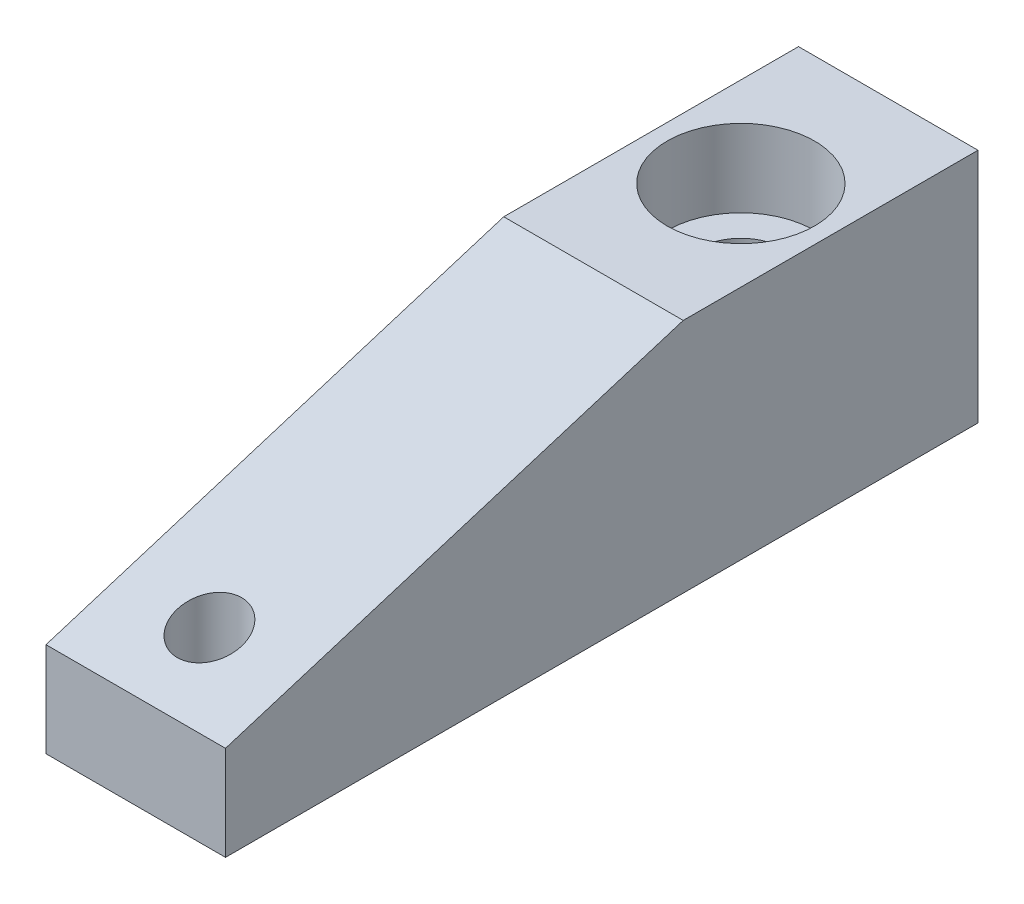
ISO-10303-21;
HEADER;
FILE_DESCRIPTION(('STEP AP214'),'2;1');
FILE_NAME('part.step','',(''),(''),'','','');
FILE_SCHEMA(('AUTOMOTIVE_DESIGN { 1 0 10303 214 1 1 1 1 }'));
ENDSEC;
DATA;
#1=APPLICATION_CONTEXT('core data for automotive mechanical design processes');
#2=APPLICATION_PROTOCOL_DEFINITION('international standard','automotive_design',2000,#1);
#3=PRODUCT_CONTEXT('',#1,'mechanical');
#4=PRODUCT('Part','Part','',(#3));
#5=PRODUCT_RELATED_PRODUCT_CATEGORY('part','',(#4));
#6=PRODUCT_DEFINITION_FORMATION('','',#4);
#7=PRODUCT_DEFINITION_CONTEXT('part definition',#1,'design');
#8=PRODUCT_DEFINITION('design','',#6,#7);
#9=PRODUCT_DEFINITION_SHAPE('','',#8);
#10=(LENGTH_UNIT() NAMED_UNIT(*) SI_UNIT(.MILLI.,.METRE.));
#11=(NAMED_UNIT(*) PLANE_ANGLE_UNIT() SI_UNIT($,.RADIAN.));
#12=(NAMED_UNIT(*) SI_UNIT($,.STERADIAN.) SOLID_ANGLE_UNIT());
#13=UNCERTAINTY_MEASURE_WITH_UNIT(LENGTH_MEASURE(1.E-05),#10,'distance_accuracy_value','');
#14=(GEOMETRIC_REPRESENTATION_CONTEXT(3) GLOBAL_UNCERTAINTY_ASSIGNED_CONTEXT((#13)) GLOBAL_UNIT_ASSIGNED_CONTEXT((#10,
#11,#12)) REPRESENTATION_CONTEXT('',''));
#15=CARTESIAN_POINT('',(0.,0.,0.));
#16=DIRECTION('',(0.,0.,1.));
#17=DIRECTION('',(1.,0.,0.));
#18=AXIS2_PLACEMENT_3D('',#15,#16,#17);
#19=CARTESIAN_POINT('',(0.,12.7,0.));
#20=DIRECTION('',(1.,0.,0.));
#21=DIRECTION('',(0.,0.,-1.));
#22=AXIS2_PLACEMENT_3D('',#19,#20,#21);
#23=PLANE('',#22);
#24=DIRECTION('',(0.,-1.,0.));
#25=VECTOR('',#24,1.);
#26=CARTESIAN_POINT('',(0.,12.7,40.4622));
#27=LINE('',#26,#25);
#28=CARTESIAN_POINT('',(0.,5.08,40.4622));
#29=VERTEX_POINT('',#28);
#30=CARTESIAN_POINT('',(0.,0.,40.4622));
#31=VERTEX_POINT('',#30);
#32=EDGE_CURVE('E117',#29,#31,#27,.T.);
#33=ORIENTED_EDGE('',*,*,#32,.F.);
#34=DIRECTION('',(0.,0.295747987182093,-0.95526599859816));
#35=VECTOR('',#34,1.);
#36=CARTESIAN_POINT('',(0.,5.08,40.4622));
#37=LINE('',#36,#35);
#38=CARTESIAN_POINT('',(0.,12.7,15.8496));
#39=VERTEX_POINT('',#38);
#40=EDGE_CURVE('E183',#29,#39,#37,.T.);
#41=ORIENTED_EDGE('',*,*,#40,.T.);
#42=DIRECTION('',(0.,0.,1.));
#43=VECTOR('',#42,1.);
#44=CARTESIAN_POINT('',(0.,12.7,0.));
#45=LINE('',#44,#43);
#46=CARTESIAN_POINT('',(0.,12.7,0.));
#47=VERTEX_POINT('',#46);
#48=EDGE_CURVE('E91',#47,#39,#45,.T.);
#49=ORIENTED_EDGE('',*,*,#48,.F.);
#50=DIRECTION('',(0.,-1.,0.));
#51=VECTOR('',#50,1.);
#52=CARTESIAN_POINT('',(0.,12.7,0.));
#53=LINE('',#52,#51);
#54=CARTESIAN_POINT('',(0.,0.,0.));
#55=VERTEX_POINT('',#54);
#56=EDGE_CURVE('E84',#47,#55,#53,.T.);
#57=ORIENTED_EDGE('',*,*,#56,.T.);
#58=DIRECTION('',(0.,0.,1.));
#59=VECTOR('',#58,1.);
#60=CARTESIAN_POINT('',(0.,0.,0.));
#61=LINE('',#60,#59);
#62=EDGE_CURVE('E97',#55,#31,#61,.T.);
#63=ORIENTED_EDGE('',*,*,#62,.T.);
#64=EDGE_LOOP('',(#33,#41,#49,#57,#63));
#65=FACE_BOUND('',#64,.T.);
#66=ADVANCED_FACE('F37',(#65),#23,.F.);
#67=CARTESIAN_POINT('',(0.,12.7,40.4622));
#68=DIRECTION('',(0.,0.,-1.));
#69=DIRECTION('',(-1.,0.,0.));
#70=AXIS2_PLACEMENT_3D('',#67,#68,#69);
#71=PLANE('',#70);
#72=DIRECTION('',(0.,-1.,0.));
#73=VECTOR('',#72,1.);
#74=CARTESIAN_POINT('',(9.652,12.7,40.4622));
#75=LINE('',#74,#73);
#76=CARTESIAN_POINT('',(9.652,5.08,40.4622));
#77=VERTEX_POINT('',#76);
#78=CARTESIAN_POINT('',(9.652,0.,40.4622));
#79=VERTEX_POINT('',#78);
#80=EDGE_CURVE('E115',#77,#79,#75,.T.);
#81=ORIENTED_EDGE('',*,*,#80,.F.);
#82=DIRECTION('',(1.,0.,0.));
#83=VECTOR('',#82,1.);
#84=CARTESIAN_POINT('',(0.,5.08,40.4622));
#85=LINE('',#84,#83);
#86=EDGE_CURVE('E187',#29,#77,#85,.T.);
#87=ORIENTED_EDGE('',*,*,#86,.F.);
#88=ORIENTED_EDGE('',*,*,#32,.T.);
#89=DIRECTION('',(1.,0.,0.));
#90=VECTOR('',#89,1.);
#91=CARTESIAN_POINT('',(0.,0.,40.4622));
#92=LINE('',#91,#90);
#93=EDGE_CURVE('E103',#31,#79,#92,.T.);
#94=ORIENTED_EDGE('',*,*,#93,.T.);
#95=EDGE_LOOP('',(#81,#87,#88,#94));
#96=FACE_BOUND('',#95,.T.);
#97=ADVANCED_FACE('F139',(#96),#71,.F.);
#98=CARTESIAN_POINT('',(9.652,12.7,0.));
#99=DIRECTION('',(-1.,0.,0.));
#100=DIRECTION('',(0.,0.,1.));
#101=AXIS2_PLACEMENT_3D('',#98,#99,#100);
#102=PLANE('',#101);
#103=DIRECTION('',(0.,0.,-1.));
#104=VECTOR('',#103,1.);
#105=CARTESIAN_POINT('',(9.652,12.7,0.));
#106=LINE('',#105,#104);
#107=CARTESIAN_POINT('',(9.652,12.7,15.8496));
#108=VERTEX_POINT('',#107);
#109=CARTESIAN_POINT('',(9.652,12.7,0.));
#110=VERTEX_POINT('',#109);
#111=EDGE_CURVE('E203',#108,#110,#106,.T.);
#112=ORIENTED_EDGE('',*,*,#111,.F.);
#113=DIRECTION('',(0.,0.295747987182093,-0.95526599859816));
#114=VECTOR('',#113,1.);
#115=CARTESIAN_POINT('',(9.652,5.08,40.4622));
#116=LINE('',#115,#114);
#117=EDGE_CURVE('E53',#77,#108,#116,.T.);
#118=ORIENTED_EDGE('',*,*,#117,.F.);
#119=ORIENTED_EDGE('',*,*,#80,.T.);
#120=DIRECTION('',(0.,0.,-1.));
#121=VECTOR('',#120,1.);
#122=CARTESIAN_POINT('',(9.652,0.,0.));
#123=LINE('',#122,#121);
#124=CARTESIAN_POINT('',(9.652,0.,0.));
#125=VERTEX_POINT('',#124);
#126=EDGE_CURVE('E92',#79,#125,#123,.T.);
#127=ORIENTED_EDGE('',*,*,#126,.T.);
#128=DIRECTION('',(0.,-1.,0.));
#129=VECTOR('',#128,1.);
#130=CARTESIAN_POINT('',(9.652,12.7,0.));
#131=LINE('',#130,#129);
#132=EDGE_CURVE('E87',#110,#125,#131,.T.);
#133=ORIENTED_EDGE('',*,*,#132,.F.);
#134=EDGE_LOOP('',(#112,#118,#119,#127,#133));
#135=FACE_BOUND('',#134,.T.);
#136=ADVANCED_FACE('F143',(#135),#102,.F.);
#137=CARTESIAN_POINT('',(0.,12.7,0.));
#138=DIRECTION('',(0.,0.,1.));
#139=DIRECTION('',(1.,0.,0.));
#140=AXIS2_PLACEMENT_3D('',#137,#138,#139);
#141=PLANE('',#140);
#142=DIRECTION('',(-1.,0.,0.));
#143=VECTOR('',#142,1.);
#144=CARTESIAN_POINT('',(0.,0.,0.));
#145=LINE('',#144,#143);
#146=EDGE_CURVE('E81',#125,#55,#145,.T.);
#147=ORIENTED_EDGE('',*,*,#146,.T.);
#148=ORIENTED_EDGE('',*,*,#56,.F.);
#149=DIRECTION('',(-1.,0.,0.));
#150=VECTOR('',#149,1.);
#151=CARTESIAN_POINT('',(0.,12.7,0.));
#152=LINE('',#151,#150);
#153=EDGE_CURVE('E62',#110,#47,#152,.T.);
#154=ORIENTED_EDGE('',*,*,#153,.F.);
#155=ORIENTED_EDGE('',*,*,#132,.T.);
#156=EDGE_LOOP('',(#147,#148,#154,#155));
#157=FACE_BOUND('',#156,.T.);
#158=ADVANCED_FACE('F83',(#157),#141,.F.);
#159=CARTESIAN_POINT('',(0.,12.7,0.));
#160=DIRECTION('',(0.,1.,0.));
#161=DIRECTION('',(0.,0.,1.));
#162=AXIS2_PLACEMENT_3D('',#159,#160,#161);
#163=PLANE('',#162);
#164=DIRECTION('',(1.,0.,0.));
#165=VECTOR('',#164,1.);
#166=CARTESIAN_POINT('',(0.,12.7,15.8496));
#167=LINE('',#166,#165);
#168=EDGE_CURVE('E189',#39,#108,#167,.T.);
#169=ORIENTED_EDGE('',*,*,#168,.T.);
#170=ORIENTED_EDGE('',*,*,#111,.T.);
#171=ORIENTED_EDGE('',*,*,#153,.T.);
#172=ORIENTED_EDGE('',*,*,#48,.T.);
#173=EDGE_LOOP('',(#169,#170,#171,#172));
#174=FACE_BOUND('',#173,.T.);
#175=CARTESIAN_POINT('',(4.826,12.7,7.9248));
#176=DIRECTION('',(0.,1.,0.));
#177=DIRECTION('',(0.,0.,1.));
#178=AXIS2_PLACEMENT_3D('',#175,#176,#177);
#179=CIRCLE('',#178,3.9624);
#180=CARTESIAN_POINT('',(4.826,12.7,11.8872));
#181=VERTEX_POINT('',#180);
#182=EDGE_CURVE('E104',#181,#181,#179,.T.);
#183=ORIENTED_EDGE('',*,*,#182,.F.);
#184=EDGE_LOOP('',(#183));
#185=FACE_BOUND('',#184,.T.);
#186=ADVANCED_FACE('F152',(#174,#185),#163,.T.);
#187=CARTESIAN_POINT('',(0.,0.,0.));
#188=DIRECTION('',(0.,1.,0.));
#189=DIRECTION('',(0.,0.,1.));
#190=AXIS2_PLACEMENT_3D('',#187,#188,#189);
#191=PLANE('',#190);
#192=CARTESIAN_POINT('',(4.826,0.,36.4998));
#193=DIRECTION('',(0.,-1.,0.));
#194=DIRECTION('',(0.,0.,-1.));
#195=AXIS2_PLACEMENT_3D('',#192,#193,#194);
#196=CIRCLE('',#195,1.7272);
#197=CARTESIAN_POINT('',(4.826,0.,34.7726));
#198=VERTEX_POINT('',#197);
#199=EDGE_CURVE('E180',#198,#198,#196,.T.);
#200=ORIENTED_EDGE('',*,*,#199,.F.);
#201=EDGE_LOOP('',(#200));
#202=FACE_BOUND('',#201,.T.);
#203=CARTESIAN_POINT('',(4.826,0.,7.9248));
#204=DIRECTION('',(0.,1.,0.));
#205=DIRECTION('',(0.,0.,1.));
#206=AXIS2_PLACEMENT_3D('',#203,#204,#205);
#207=CIRCLE('',#206,3.1115);
#208=CARTESIAN_POINT('',(4.826,0.,11.0363));
#209=VERTEX_POINT('',#208);
#210=EDGE_CURVE('E191',#209,#209,#207,.T.);
#211=ORIENTED_EDGE('',*,*,#210,.T.);
#212=EDGE_LOOP('',(#211));
#213=FACE_BOUND('',#212,.T.);
#214=ORIENTED_EDGE('',*,*,#62,.F.);
#215=ORIENTED_EDGE('',*,*,#146,.F.);
#216=ORIENTED_EDGE('',*,*,#126,.F.);
#217=ORIENTED_EDGE('',*,*,#93,.F.);
#218=EDGE_LOOP('',(#214,#215,#216,#217));
#219=FACE_BOUND('',#218,.T.);
#220=ADVANCED_FACE('F101',(#202,#213,#219),#191,.F.);
#221=CARTESIAN_POINT('',(4.826,31.6794444444445,7.9248));
#222=DIRECTION('',(0.,1.,0.));
#223=DIRECTION('',(0.,0.,1.));
#224=AXIS2_PLACEMENT_3D('',#221,#222,#223);
#225=CYLINDRICAL_SURFACE('',#224,3.9624);
#226=CARTESIAN_POINT('',(4.826,8.5344,7.9248));
#227=DIRECTION('',(0.,1.,0.));
#228=DIRECTION('',(0.,0.,1.));
#229=AXIS2_PLACEMENT_3D('',#226,#227,#228);
#230=CIRCLE('',#229,3.9624);
#231=CARTESIAN_POINT('',(4.826,8.5344,11.8872));
#232=VERTEX_POINT('',#231);
#233=EDGE_CURVE('E108',#232,#232,#230,.T.);
#234=ORIENTED_EDGE('',*,*,#233,.F.);
#235=EDGE_LOOP('',(#234));
#236=FACE_BOUND('',#235,.T.);
#237=ORIENTED_EDGE('',*,*,#182,.T.);
#238=EDGE_LOOP('',(#237));
#239=FACE_BOUND('',#238,.T.);
#240=ADVANCED_FACE('F155',(#236,#239),#225,.F.);
#241=CARTESIAN_POINT('',(4.826,8.5344,11.8872));
#242=DIRECTION('',(0.,-1.,0.));
#243=DIRECTION('',(0.,0.,-1.));
#244=AXIS2_PLACEMENT_3D('',#241,#242,#243);
#245=PLANE('',#244);
#246=CARTESIAN_POINT('',(4.826,8.5344,7.9248));
#247=DIRECTION('',(0.,1.,0.));
#248=DIRECTION('',(0.,0.,1.));
#249=AXIS2_PLACEMENT_3D('',#246,#247,#248);
#250=CIRCLE('',#249,2.286);
#251=CARTESIAN_POINT('',(4.826,8.5344,10.2108));
#252=VERTEX_POINT('',#251);
#253=EDGE_CURVE('E198',#252,#252,#250,.T.);
#254=ORIENTED_EDGE('',*,*,#253,.F.);
#255=EDGE_LOOP('',(#254));
#256=FACE_BOUND('',#255,.T.);
#257=ORIENTED_EDGE('',*,*,#233,.T.);
#258=EDGE_LOOP('',(#257));
#259=FACE_BOUND('',#258,.T.);
#260=ADVANCED_FACE('F161',(#256,#259),#245,.F.);
#261=CARTESIAN_POINT('',(4.826,31.6794444444445,7.9248));
#262=DIRECTION('',(0.,1.,0.));
#263=DIRECTION('',(0.,0.,1.));
#264=AXIS2_PLACEMENT_3D('',#261,#262,#263);
#265=CYLINDRICAL_SURFACE('',#264,2.286);
#266=CARTESIAN_POINT('',(4.826,6.6548,7.9248));
#267=DIRECTION('',(0.,1.,0.));
#268=DIRECTION('',(0.,0.,1.));
#269=AXIS2_PLACEMENT_3D('',#266,#267,#268);
#270=CIRCLE('',#269,2.286);
#271=CARTESIAN_POINT('',(4.826,6.6548,10.2108));
#272=VERTEX_POINT('',#271);
#273=EDGE_CURVE('E195',#272,#272,#270,.T.);
#274=ORIENTED_EDGE('',*,*,#273,.F.);
#275=EDGE_LOOP('',(#274));
#276=FACE_BOUND('',#275,.T.);
#277=ORIENTED_EDGE('',*,*,#253,.T.);
#278=EDGE_LOOP('',(#277));
#279=FACE_BOUND('',#278,.T.);
#280=ADVANCED_FACE('F165',(#276,#279),#265,.F.);
#281=CARTESIAN_POINT('',(4.826,6.6548,10.2108));
#282=DIRECTION('',(0.,1.,0.));
#283=DIRECTION('',(0.,0.,1.));
#284=AXIS2_PLACEMENT_3D('',#281,#282,#283);
#285=PLANE('',#284);
#286=CARTESIAN_POINT('',(4.826,6.6548,7.9248));
#287=DIRECTION('',(0.,1.,0.));
#288=DIRECTION('',(0.,0.,1.));
#289=AXIS2_PLACEMENT_3D('',#286,#287,#288);
#290=CIRCLE('',#289,2.58500532492553);
#291=CARTESIAN_POINT('',(4.826,6.6548,10.5098053249255));
#292=VERTEX_POINT('',#291);
#293=EDGE_CURVE('E11',#292,#292,#290,.F.);
#294=ORIENTED_EDGE('',*,*,#293,.T.);
#295=EDGE_LOOP('',(#294));
#296=FACE_BOUND('',#295,.T.);
#297=ORIENTED_EDGE('',*,*,#273,.T.);
#298=EDGE_LOOP('',(#297));
#299=FACE_BOUND('',#298,.T.);
#300=ADVANCED_FACE('F135',(#296,#299),#285,.F.);
#301=CARTESIAN_POINT('',(4.826,6.6548,7.9248));
#302=DIRECTION('',(0.,-1.,0.));
#303=DIRECTION('',(0.,0.,-1.));
#304=AXIS2_PLACEMENT_3D('',#301,#302,#303);
#305=CONICAL_SURFACE('',#304,2.70447499542256,0.061086523819802);
#306=CARTESIAN_POINT('',(4.826,6.53555316452093,7.9248));
#307=DIRECTION('',(0.,-1.,0.));
#308=DIRECTION('',(0.,0.,-1.));
#309=AXIS2_PLACEMENT_3D('',#306,#307,#308);
#310=CIRCLE('',#309,2.71176844432511);
#311=CARTESIAN_POINT('',(4.826,6.53555316452093,5.21303155567489));
#312=VERTEX_POINT('',#311);
#313=EDGE_CURVE('E46',#312,#312,#310,.F.);
#314=ORIENTED_EDGE('',*,*,#313,.T.);
#315=EDGE_LOOP('',(#314));
#316=FACE_BOUND('',#315,.T.);
#317=ORIENTED_EDGE('',*,*,#210,.F.);
#318=EDGE_LOOP('',(#317));
#319=FACE_BOUND('',#318,.T.);
#320=ADVANCED_FACE('F122',(#316,#319),#305,.F.);
#321=CARTESIAN_POINT('',(4.826,6.5278,7.9248));
#322=DIRECTION('',(0.,1.,0.));
#323=DIRECTION('',(0.,0.,1.));
#324=AXIS2_PLACEMENT_3D('',#321,#322,#323);
#325=TOROIDAL_SURFACE('',#324,2.58500532492553,0.127);
#326=ORIENTED_EDGE('',*,*,#293,.F.);
#327=EDGE_LOOP('',(#326));
#328=FACE_BOUND('',#327,.T.);
#329=ORIENTED_EDGE('',*,*,#313,.F.);
#330=EDGE_LOOP('',(#329));
#331=FACE_BOUND('',#330,.T.);
#332=ADVANCED_FACE('F39',(#328,#331),#325,.F.);
#333=CARTESIAN_POINT('',(0.,5.08,40.4622));
#334=DIRECTION('',(0.,-0.95526599859816,-0.295747987182093));
#335=DIRECTION('',(0.,0.295747987182093,-0.955265998598161));
#336=AXIS2_PLACEMENT_3D('',#333,#334,#335);
#337=PLANE('',#336);
#338=CARTESIAN_POINT('',(4.826,6.30674922600619,36.4998));
#339=DIRECTION('',(0.,-0.95526599859816,-0.295747987182093));
#340=DIRECTION('',(0.,-0.295747987182093,0.955265998598161));
#341=AXIS2_PLACEMENT_3D('',#338,#339,#340);
#342=ELLIPSE('',#341,1.80808277750348,1.7272);
#343=CARTESIAN_POINT('',(4.826,5.77201238390093,38.227));
#344=VERTEX_POINT('',#343);
#345=EDGE_CURVE('E41',#344,#344,#342,.T.);
#346=ORIENTED_EDGE('',*,*,#345,.T.);
#347=EDGE_LOOP('',(#346));
#348=FACE_BOUND('',#347,.T.);
#349=ORIENTED_EDGE('',*,*,#117,.T.);
#350=ORIENTED_EDGE('',*,*,#168,.F.);
#351=ORIENTED_EDGE('',*,*,#40,.F.);
#352=ORIENTED_EDGE('',*,*,#86,.T.);
#353=EDGE_LOOP('',(#349,#350,#351,#352));
#354=FACE_BOUND('',#353,.T.);
#355=ADVANCED_FACE('F126',(#348,#354),#337,.F.);
#356=CARTESIAN_POINT('',(4.826,12.7,36.4998));
#357=DIRECTION('',(0.,-1.,0.));
#358=DIRECTION('',(0.,0.,-1.));
#359=AXIS2_PLACEMENT_3D('',#356,#357,#358);
#360=CYLINDRICAL_SURFACE('',#359,1.7272);
#361=ORIENTED_EDGE('',*,*,#199,.T.);
#362=EDGE_LOOP('',(#361));
#363=FACE_BOUND('',#362,.T.);
#364=ORIENTED_EDGE('',*,*,#345,.F.);
#365=EDGE_LOOP('',(#364));
#366=FACE_BOUND('',#365,.T.);
#367=ADVANCED_FACE('F132',(#363,#366),#360,.F.);
#368=CLOSED_SHELL('',(#66,#97,#136,#158,#186,#220,#240,#260,#280,#300,#320,#332,#355,#367));
#369=MANIFOLD_SOLID_BREP('B2',#368);
#370=ADVANCED_BREP_SHAPE_REPRESENTATION('',(#18,#369),#14);
#371=SHAPE_DEFINITION_REPRESENTATION(#9,#370);
ENDSEC;
END-ISO-10303-21;
